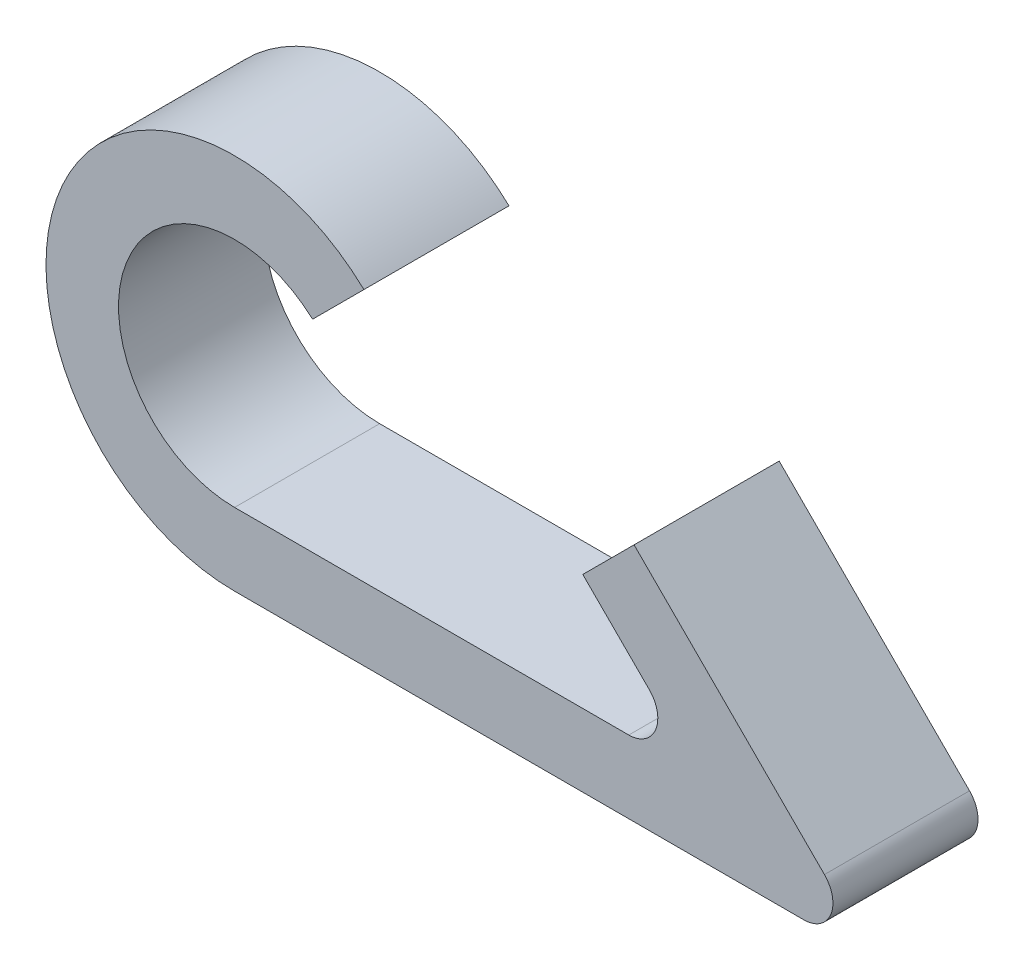
ISO-10303-21;
HEADER;
FILE_DESCRIPTION(('STEP AP214'),'2;1');
FILE_NAME('part.step','',(''),(''),'','','');
FILE_SCHEMA(('AUTOMOTIVE_DESIGN { 1 0 10303 214 1 1 1 1 }'));
ENDSEC;
DATA;
#1=APPLICATION_CONTEXT('core data for automotive mechanical design processes');
#2=APPLICATION_PROTOCOL_DEFINITION('international standard','automotive_design',2000,#1);
#3=PRODUCT_CONTEXT('',#1,'mechanical');
#4=PRODUCT('Part','Part','',(#3));
#5=PRODUCT_RELATED_PRODUCT_CATEGORY('part','',(#4));
#6=PRODUCT_DEFINITION_FORMATION('','',#4);
#7=PRODUCT_DEFINITION_CONTEXT('part definition',#1,'design');
#8=PRODUCT_DEFINITION('design','',#6,#7);
#9=PRODUCT_DEFINITION_SHAPE('','',#8);
#10=(LENGTH_UNIT() NAMED_UNIT(*) SI_UNIT(.MILLI.,.METRE.));
#11=(NAMED_UNIT(*) PLANE_ANGLE_UNIT() SI_UNIT($,.RADIAN.));
#12=(NAMED_UNIT(*) SI_UNIT($,.STERADIAN.) SOLID_ANGLE_UNIT());
#13=UNCERTAINTY_MEASURE_WITH_UNIT(LENGTH_MEASURE(1.E-05),#10,'distance_accuracy_value','');
#14=(GEOMETRIC_REPRESENTATION_CONTEXT(3) GLOBAL_UNCERTAINTY_ASSIGNED_CONTEXT((#13)) GLOBAL_UNIT_ASSIGNED_CONTEXT((#10,
#11,#12)) REPRESENTATION_CONTEXT('',''));
#15=CARTESIAN_POINT('',(0.,0.,0.));
#16=DIRECTION('',(0.,0.,1.));
#17=DIRECTION('',(1.,0.,0.));
#18=AXIS2_PLACEMENT_3D('',#15,#16,#17);
#19=CARTESIAN_POINT('',(0.,0.,5.));
#20=DIRECTION('',(0.,0.,-1.));
#21=DIRECTION('',(-1.,0.,0.));
#22=AXIS2_PLACEMENT_3D('',#19,#20,#21);
#23=CYLINDRICAL_SURFACE('',#22,4.);
#24=CARTESIAN_POINT('',(0.,0.,0.));
#25=DIRECTION('',(0.,0.,-1.));
#26=DIRECTION('',(1.,0.,0.));
#27=AXIS2_PLACEMENT_3D('',#24,#25,#26);
#28=CIRCLE('',#27,4.);
#29=CARTESIAN_POINT('',(0.,-4.,0.));
#30=VERTEX_POINT('',#29);
#31=CARTESIAN_POINT('',(2.68855511695436,2.96170075853361,0.));
#32=VERTEX_POINT('',#31);
#33=EDGE_CURVE('E141',#30,#32,#28,.T.);
#34=ORIENTED_EDGE('',*,*,#33,.T.);
#35=DIRECTION('',(0.,0.,-1.));
#36=VECTOR('',#35,1.);
#37=CARTESIAN_POINT('',(2.68855511695436,2.96170075853361,5.));
#38=LINE('',#37,#36);
#39=CARTESIAN_POINT('',(2.68855511695436,2.96170075853361,5.));
#40=VERTEX_POINT('',#39);
#41=EDGE_CURVE('E11',#40,#32,#38,.T.);
#42=ORIENTED_EDGE('',*,*,#41,.F.);
#43=CARTESIAN_POINT('',(0.,0.,5.));
#44=DIRECTION('',(0.,0.,-1.));
#45=DIRECTION('',(1.,0.,0.));
#46=AXIS2_PLACEMENT_3D('',#43,#44,#45);
#47=CIRCLE('',#46,4.);
#48=CARTESIAN_POINT('',(0.,-4.,5.));
#49=VERTEX_POINT('',#48);
#50=EDGE_CURVE('E159',#49,#40,#47,.T.);
#51=ORIENTED_EDGE('',*,*,#50,.F.);
#52=DIRECTION('',(0.,0.,-1.));
#53=VECTOR('',#52,1.);
#54=CARTESIAN_POINT('',(0.,-4.,5.));
#55=LINE('',#54,#53);
#56=EDGE_CURVE('E137',#49,#30,#55,.T.);
#57=ORIENTED_EDGE('',*,*,#56,.T.);
#58=EDGE_LOOP('',(#34,#42,#51,#57));
#59=FACE_BOUND('',#58,.T.);
#60=ADVANCED_FACE('F33',(#59),#23,.F.);
#61=CARTESIAN_POINT('',(2.68855511695436,2.96170075853361,5.));
#62=DIRECTION('',(-0.707106781186544,0.707106781186551,0.));
#63=DIRECTION('',(-0.707106781186551,-0.707106781186544,0.));
#64=AXIS2_PLACEMENT_3D('',#61,#62,#63);
#65=PLANE('',#64);
#66=DIRECTION('',(0.707106781186551,0.707106781186544,0.));
#67=VECTOR('',#66,1.);
#68=CARTESIAN_POINT('',(2.68855511695436,2.96170075853361,0.));
#69=LINE('',#68,#67);
#70=CARTESIAN_POINT('',(4.45759172400213,4.73073736558136,0.));
#71=VERTEX_POINT('',#70);
#72=EDGE_CURVE('E144',#32,#71,#69,.T.);
#73=ORIENTED_EDGE('',*,*,#72,.T.);
#74=DIRECTION('',(0.,0.,-1.));
#75=VECTOR('',#74,1.);
#76=CARTESIAN_POINT('',(4.45759172400213,4.73073736558136,5.));
#77=LINE('',#76,#75);
#78=CARTESIAN_POINT('',(4.45759172400213,4.73073736558136,5.));
#79=VERTEX_POINT('',#78);
#80=EDGE_CURVE('E41',#79,#71,#77,.T.);
#81=ORIENTED_EDGE('',*,*,#80,.F.);
#82=DIRECTION('',(0.707106781186551,0.707106781186544,0.));
#83=VECTOR('',#82,1.);
#84=CARTESIAN_POINT('',(2.68855511695436,2.96170075853361,5.));
#85=LINE('',#84,#83);
#86=EDGE_CURVE('E98',#40,#79,#85,.T.);
#87=ORIENTED_EDGE('',*,*,#86,.F.);
#88=ORIENTED_EDGE('',*,*,#41,.T.);
#89=EDGE_LOOP('',(#73,#81,#87,#88));
#90=FACE_BOUND('',#89,.T.);
#91=ADVANCED_FACE('F208',(#90),#65,.F.);
#92=CARTESIAN_POINT('',(0.,0.,5.));
#93=DIRECTION('',(0.,0.,-1.));
#94=DIRECTION('',(-1.,0.,0.));
#95=AXIS2_PLACEMENT_3D('',#92,#93,#94);
#96=CYLINDRICAL_SURFACE('',#95,6.5);
#97=CARTESIAN_POINT('',(0.,0.,0.));
#98=DIRECTION('',(0.,0.,1.));
#99=DIRECTION('',(1.,0.,0.));
#100=AXIS2_PLACEMENT_3D('',#97,#98,#99);
#101=CIRCLE('',#100,6.5);
#102=CARTESIAN_POINT('',(0.,-6.5,0.));
#103=VERTEX_POINT('',#102);
#104=EDGE_CURVE('E146',#71,#103,#101,.T.);
#105=ORIENTED_EDGE('',*,*,#104,.T.);
#106=DIRECTION('',(0.,0.,-1.));
#107=VECTOR('',#106,1.);
#108=CARTESIAN_POINT('',(0.,-6.5,5.));
#109=LINE('',#108,#107);
#110=CARTESIAN_POINT('',(0.,-6.5,5.));
#111=VERTEX_POINT('',#110);
#112=EDGE_CURVE('E172',#111,#103,#109,.T.);
#113=ORIENTED_EDGE('',*,*,#112,.F.);
#114=CARTESIAN_POINT('',(0.,0.,5.));
#115=DIRECTION('',(0.,0.,1.));
#116=DIRECTION('',(1.,0.,0.));
#117=AXIS2_PLACEMENT_3D('',#114,#115,#116);
#118=CIRCLE('',#117,6.5);
#119=EDGE_CURVE('E180',#79,#111,#118,.T.);
#120=ORIENTED_EDGE('',*,*,#119,.F.);
#121=ORIENTED_EDGE('',*,*,#80,.T.);
#122=EDGE_LOOP('',(#105,#113,#120,#121));
#123=FACE_BOUND('',#122,.T.);
#124=ADVANCED_FACE('F178',(#123),#96,.T.);
#125=CARTESIAN_POINT('',(0.,-6.5,5.));
#126=DIRECTION('',(0.,1.,0.));
#127=DIRECTION('',(0.,0.,1.));
#128=AXIS2_PLACEMENT_3D('',#125,#126,#127);
#129=PLANE('',#128);
#130=DIRECTION('',(1.,0.,0.));
#131=VECTOR('',#130,1.);
#132=CARTESIAN_POINT('',(0.,-6.5,0.));
#133=LINE('',#132,#131);
#134=CARTESIAN_POINT('',(19.6213203435597,-6.5,0.));
#135=VERTEX_POINT('',#134);
#136=EDGE_CURVE('E148',#103,#135,#133,.T.);
#137=ORIENTED_EDGE('',*,*,#136,.T.);
#138=DIRECTION('',(0.,0.,-1.));
#139=VECTOR('',#138,1.);
#140=CARTESIAN_POINT('',(19.6213203435597,-6.5,5.));
#141=LINE('',#140,#139);
#142=CARTESIAN_POINT('',(19.6213203435597,-6.5,5.));
#143=VERTEX_POINT('',#142);
#144=EDGE_CURVE('E169',#143,#135,#141,.T.);
#145=ORIENTED_EDGE('',*,*,#144,.F.);
#146=DIRECTION('',(1.,0.,0.));
#147=VECTOR('',#146,1.);
#148=CARTESIAN_POINT('',(0.,-6.5,5.));
#149=LINE('',#148,#147);
#150=EDGE_CURVE('E198',#111,#143,#149,.T.);
#151=ORIENTED_EDGE('',*,*,#150,.F.);
#152=ORIENTED_EDGE('',*,*,#112,.T.);
#153=EDGE_LOOP('',(#137,#145,#151,#152));
#154=FACE_BOUND('',#153,.T.);
#155=ADVANCED_FACE('F189',(#154),#129,.F.);
#156=CARTESIAN_POINT('',(19.6213203435597,-5.5,5.));
#157=DIRECTION('',(0.,0.,-1.));
#158=DIRECTION('',(-1.,0.,0.));
#159=AXIS2_PLACEMENT_3D('',#156,#157,#158);
#160=CYLINDRICAL_SURFACE('',#159,1.);
#161=CARTESIAN_POINT('',(19.6213203435597,-5.5,0.));
#162=DIRECTION('',(0.,0.,1.));
#163=DIRECTION('',(1.,0.,0.));
#164=AXIS2_PLACEMENT_3D('',#161,#162,#163);
#165=CIRCLE('',#164,1.);
#166=CARTESIAN_POINT('',(20.3284271247462,-4.79289321881345,0.));
#167=VERTEX_POINT('',#166);
#168=EDGE_CURVE('E150',#135,#167,#165,.T.);
#169=ORIENTED_EDGE('',*,*,#168,.T.);
#170=DIRECTION('',(0.,0.,-1.));
#171=VECTOR('',#170,1.);
#172=CARTESIAN_POINT('',(20.3284271247462,-4.79289321881345,5.));
#173=LINE('',#172,#171);
#174=CARTESIAN_POINT('',(20.3284271247462,-4.79289321881345,5.));
#175=VERTEX_POINT('',#174);
#176=EDGE_CURVE('E166',#175,#167,#173,.T.);
#177=ORIENTED_EDGE('',*,*,#176,.F.);
#178=CARTESIAN_POINT('',(19.6213203435597,-5.5,5.));
#179=DIRECTION('',(0.,0.,1.));
#180=DIRECTION('',(1.,0.,0.));
#181=AXIS2_PLACEMENT_3D('',#178,#179,#180);
#182=CIRCLE('',#181,1.);
#183=EDGE_CURVE('E195',#143,#175,#182,.T.);
#184=ORIENTED_EDGE('',*,*,#183,.F.);
#185=ORIENTED_EDGE('',*,*,#144,.T.);
#186=EDGE_LOOP('',(#169,#177,#184,#185));
#187=FACE_BOUND('',#186,.T.);
#188=ADVANCED_FACE('F193',(#187),#160,.T.);
#189=CARTESIAN_POINT('',(20.3284271247462,-4.79289321881345,5.));
#190=DIRECTION('',(-0.707106781186543,-0.707106781186552,0.));
#191=DIRECTION('',(0.707106781186552,-0.707106781186543,0.));
#192=AXIS2_PLACEMENT_3D('',#189,#190,#191);
#193=PLANE('',#192);
#194=DIRECTION('',(-0.707106781186552,0.707106781186543,0.));
#195=VECTOR('',#194,1.);
#196=CARTESIAN_POINT('',(20.3284271247462,-4.79289321881345,0.));
#197=LINE('',#196,#195);
#198=CARTESIAN_POINT('',(13.7677669529663,1.76776695296638,0.));
#199=VERTEX_POINT('',#198);
#200=EDGE_CURVE('E152',#167,#199,#197,.T.);
#201=ORIENTED_EDGE('',*,*,#200,.T.);
#202=DIRECTION('',(0.,0.,-1.));
#203=VECTOR('',#202,1.);
#204=CARTESIAN_POINT('',(13.7677669529663,1.76776695296638,5.));
#205=LINE('',#204,#203);
#206=CARTESIAN_POINT('',(13.7677669529663,1.76776695296638,5.));
#207=VERTEX_POINT('',#206);
#208=EDGE_CURVE('E163',#207,#199,#205,.T.);
#209=ORIENTED_EDGE('',*,*,#208,.F.);
#210=DIRECTION('',(-0.707106781186552,0.707106781186543,0.));
#211=VECTOR('',#210,1.);
#212=CARTESIAN_POINT('',(20.3284271247462,-4.79289321881345,5.));
#213=LINE('',#212,#211);
#214=EDGE_CURVE('E197',#175,#207,#213,.T.);
#215=ORIENTED_EDGE('',*,*,#214,.F.);
#216=ORIENTED_EDGE('',*,*,#176,.T.);
#217=EDGE_LOOP('',(#201,#209,#215,#216));
#218=FACE_BOUND('',#217,.T.);
#219=ADVANCED_FACE('F220',(#218),#193,.F.);
#220=CARTESIAN_POINT('',(13.7677669529663,1.76776695296638,5.));
#221=DIRECTION('',(0.707106781186551,-0.707106781186544,0.));
#222=DIRECTION('',(0.707106781186544,0.707106781186551,0.));
#223=AXIS2_PLACEMENT_3D('',#220,#221,#222);
#224=PLANE('',#223);
#225=DIRECTION('',(-0.707106781186544,-0.707106781186551,0.));
#226=VECTOR('',#225,1.);
#227=CARTESIAN_POINT('',(13.7677669529663,1.76776695296638,0.));
#228=LINE('',#227,#226);
#229=CARTESIAN_POINT('',(12.,0.,0.));
#230=VERTEX_POINT('',#229);
#231=EDGE_CURVE('E154',#199,#230,#228,.T.);
#232=ORIENTED_EDGE('',*,*,#231,.T.);
#233=DIRECTION('',(0.,0.,-1.));
#234=VECTOR('',#233,1.);
#235=CARTESIAN_POINT('',(12.,0.,5.));
#236=LINE('',#235,#234);
#237=CARTESIAN_POINT('',(12.,0.,5.));
#238=VERTEX_POINT('',#237);
#239=EDGE_CURVE('E132',#238,#230,#236,.T.);
#240=ORIENTED_EDGE('',*,*,#239,.F.);
#241=DIRECTION('',(-0.707106781186544,-0.707106781186551,0.));
#242=VECTOR('',#241,1.);
#243=CARTESIAN_POINT('',(13.7677669529663,1.76776695296638,5.));
#244=LINE('',#243,#242);
#245=EDGE_CURVE('E123',#207,#238,#244,.T.);
#246=ORIENTED_EDGE('',*,*,#245,.F.);
#247=ORIENTED_EDGE('',*,*,#208,.T.);
#248=EDGE_LOOP('',(#232,#240,#246,#247));
#249=FACE_BOUND('',#248,.T.);
#250=ADVANCED_FACE('F223',(#249),#224,.F.);
#251=CARTESIAN_POINT('',(12.,0.,5.));
#252=DIRECTION('',(0.707106781186544,0.707106781186552,0.));
#253=DIRECTION('',(-0.707106781186552,0.707106781186544,0.));
#254=AXIS2_PLACEMENT_3D('',#251,#252,#253);
#255=PLANE('',#254);
#256=DIRECTION('',(0.707106781186552,-0.707106781186544,0.));
#257=VECTOR('',#256,1.);
#258=CARTESIAN_POINT('',(12.,0.,0.));
#259=LINE('',#258,#257);
#260=CARTESIAN_POINT('',(14.2928932188134,-2.29289321881345,0.));
#261=VERTEX_POINT('',#260);
#262=EDGE_CURVE('E131',#230,#261,#259,.T.);
#263=ORIENTED_EDGE('',*,*,#262,.T.);
#264=DIRECTION('',(0.,0.,-1.));
#265=VECTOR('',#264,1.);
#266=CARTESIAN_POINT('',(14.2928932188134,-2.29289321881345,5.));
#267=LINE('',#266,#265);
#268=CARTESIAN_POINT('',(14.2928932188134,-2.29289321881345,5.));
#269=VERTEX_POINT('',#268);
#270=EDGE_CURVE('E128',#269,#261,#267,.T.);
#271=ORIENTED_EDGE('',*,*,#270,.F.);
#272=DIRECTION('',(0.707106781186552,-0.707106781186544,0.));
#273=VECTOR('',#272,1.);
#274=CARTESIAN_POINT('',(12.,0.,5.));
#275=LINE('',#274,#273);
#276=EDGE_CURVE('E117',#238,#269,#275,.T.);
#277=ORIENTED_EDGE('',*,*,#276,.F.);
#278=ORIENTED_EDGE('',*,*,#239,.T.);
#279=EDGE_LOOP('',(#263,#271,#277,#278));
#280=FACE_BOUND('',#279,.T.);
#281=ADVANCED_FACE('F129',(#280),#255,.F.);
#282=CARTESIAN_POINT('',(13.5857864376269,-3.,5.));
#283=DIRECTION('',(0.,0.,-1.));
#284=DIRECTION('',(-1.,0.,0.));
#285=AXIS2_PLACEMENT_3D('',#282,#283,#284);
#286=CYLINDRICAL_SURFACE('',#285,1.);
#287=CARTESIAN_POINT('',(13.5857864376269,-3.,0.));
#288=DIRECTION('',(0.,0.,-1.));
#289=DIRECTION('',(-1.,0.,0.));
#290=AXIS2_PLACEMENT_3D('',#287,#288,#289);
#291=CIRCLE('',#290,1.);
#292=CARTESIAN_POINT('',(13.5857864376269,-4.,0.));
#293=VERTEX_POINT('',#292);
#294=EDGE_CURVE('E84',#261,#293,#291,.T.);
#295=ORIENTED_EDGE('',*,*,#294,.T.);
#296=DIRECTION('',(0.,0.,-1.));
#297=VECTOR('',#296,1.);
#298=CARTESIAN_POINT('',(13.5857864376269,-4.,5.));
#299=LINE('',#298,#297);
#300=CARTESIAN_POINT('',(13.5857864376269,-4.,5.));
#301=VERTEX_POINT('',#300);
#302=EDGE_CURVE('E133',#301,#293,#299,.T.);
#303=ORIENTED_EDGE('',*,*,#302,.F.);
#304=CARTESIAN_POINT('',(13.5857864376269,-3.,5.));
#305=DIRECTION('',(0.,0.,-1.));
#306=DIRECTION('',(-1.,0.,0.));
#307=AXIS2_PLACEMENT_3D('',#304,#305,#306);
#308=CIRCLE('',#307,1.);
#309=EDGE_CURVE('E121',#269,#301,#308,.T.);
#310=ORIENTED_EDGE('',*,*,#309,.F.);
#311=ORIENTED_EDGE('',*,*,#270,.T.);
#312=EDGE_LOOP('',(#295,#303,#310,#311));
#313=FACE_BOUND('',#312,.T.);
#314=ADVANCED_FACE('F135',(#313),#286,.F.);
#315=CARTESIAN_POINT('',(13.5857864376269,-4.,5.));
#316=DIRECTION('',(0.,-1.,0.));
#317=DIRECTION('',(1.,0.,0.));
#318=AXIS2_PLACEMENT_3D('',#315,#316,#317);
#319=PLANE('',#318);
#320=DIRECTION('',(-1.,0.,0.));
#321=VECTOR('',#320,1.);
#322=CARTESIAN_POINT('',(13.5857864376269,-4.,0.));
#323=LINE('',#322,#321);
#324=EDGE_CURVE('E90',#293,#30,#323,.T.);
#325=ORIENTED_EDGE('',*,*,#324,.T.);
#326=ORIENTED_EDGE('',*,*,#56,.F.);
#327=DIRECTION('',(-1.,0.,0.));
#328=VECTOR('',#327,1.);
#329=CARTESIAN_POINT('',(13.5857864376269,-4.,5.));
#330=LINE('',#329,#328);
#331=EDGE_CURVE('E49',#301,#49,#330,.T.);
#332=ORIENTED_EDGE('',*,*,#331,.F.);
#333=ORIENTED_EDGE('',*,*,#302,.T.);
#334=EDGE_LOOP('',(#325,#326,#332,#333));
#335=FACE_BOUND('',#334,.T.);
#336=ADVANCED_FACE('F232',(#335),#319,.F.);
#337=CARTESIAN_POINT('',(0.,0.,5.));
#338=DIRECTION('',(0.,0.,1.));
#339=DIRECTION('',(1.,0.,0.));
#340=AXIS2_PLACEMENT_3D('',#337,#338,#339);
#341=PLANE('',#340);
#342=ORIENTED_EDGE('',*,*,#50,.T.);
#343=ORIENTED_EDGE('',*,*,#86,.T.);
#344=ORIENTED_EDGE('',*,*,#119,.T.);
#345=ORIENTED_EDGE('',*,*,#150,.T.);
#346=ORIENTED_EDGE('',*,*,#183,.T.);
#347=ORIENTED_EDGE('',*,*,#214,.T.);
#348=ORIENTED_EDGE('',*,*,#245,.T.);
#349=ORIENTED_EDGE('',*,*,#276,.T.);
#350=ORIENTED_EDGE('',*,*,#309,.T.);
#351=ORIENTED_EDGE('',*,*,#331,.T.);
#352=EDGE_LOOP('',(#342,#343,#344,#345,#346,#347,#348,#349,#350,#351));
#353=FACE_BOUND('',#352,.T.);
#354=ADVANCED_FACE('F119',(#353),#341,.T.);
#355=CARTESIAN_POINT('',(0.,0.,0.));
#356=DIRECTION('',(0.,0.,1.));
#357=DIRECTION('',(1.,0.,0.));
#358=AXIS2_PLACEMENT_3D('',#355,#356,#357);
#359=PLANE('',#358);
#360=ORIENTED_EDGE('',*,*,#33,.F.);
#361=ORIENTED_EDGE('',*,*,#324,.F.);
#362=ORIENTED_EDGE('',*,*,#294,.F.);
#363=ORIENTED_EDGE('',*,*,#262,.F.);
#364=ORIENTED_EDGE('',*,*,#231,.F.);
#365=ORIENTED_EDGE('',*,*,#200,.F.);
#366=ORIENTED_EDGE('',*,*,#168,.F.);
#367=ORIENTED_EDGE('',*,*,#136,.F.);
#368=ORIENTED_EDGE('',*,*,#104,.F.);
#369=ORIENTED_EDGE('',*,*,#72,.F.);
#370=EDGE_LOOP('',(#360,#361,#362,#363,#364,#365,#366,#367,#368,#369));
#371=FACE_BOUND('',#370,.T.);
#372=ADVANCED_FACE('F184',(#371),#359,.F.);
#373=CLOSED_SHELL('',(#60,#91,#124,#155,#188,#219,#250,#281,#314,#336,#354,#372));
#374=MANIFOLD_SOLID_BREP('B2',#373);
#375=ADVANCED_BREP_SHAPE_REPRESENTATION('',(#18,#374),#14);
#376=SHAPE_DEFINITION_REPRESENTATION(#9,#375);
ENDSEC;
END-ISO-10303-21;
